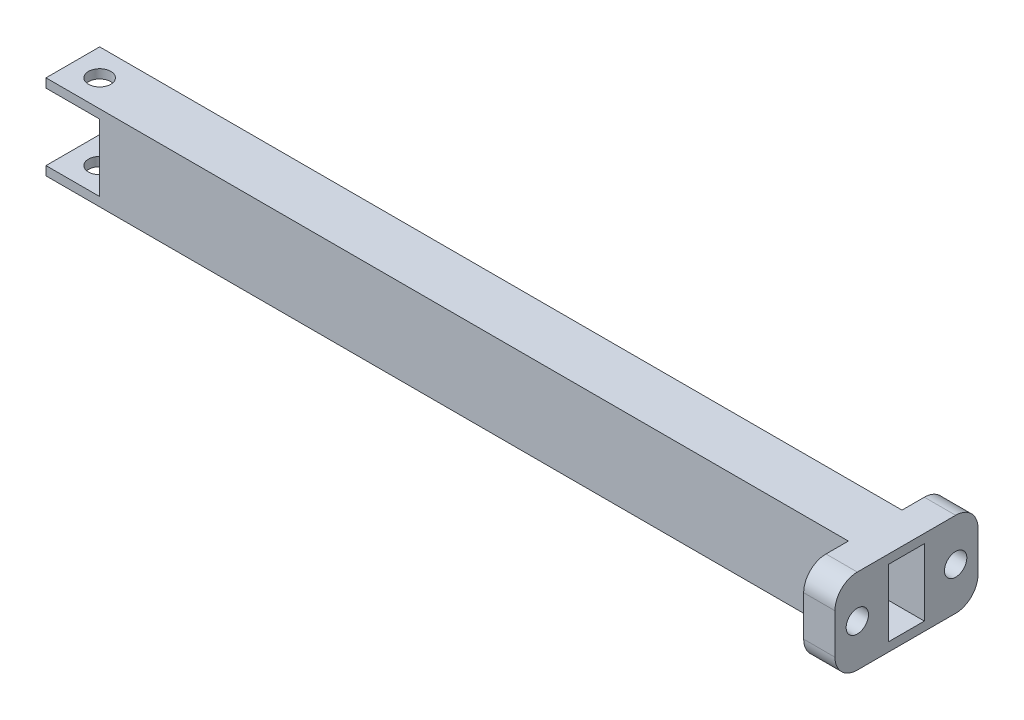
ISO-10303-21;
HEADER;
FILE_DESCRIPTION(('STEP AP214'),'2;1');
FILE_NAME('part.step','',(''),(''),'','','');
FILE_SCHEMA(('AUTOMOTIVE_DESIGN { 1 0 10303 214 1 1 1 1 }'));
ENDSEC;
DATA;
#1=APPLICATION_CONTEXT('core data for automotive mechanical design processes');
#2=APPLICATION_PROTOCOL_DEFINITION('international standard','automotive_design',2000,#1);
#3=PRODUCT_CONTEXT('',#1,'mechanical');
#4=PRODUCT('Part','Part','',(#3));
#5=PRODUCT_RELATED_PRODUCT_CATEGORY('part','',(#4));
#6=PRODUCT_DEFINITION_FORMATION('','',#4);
#7=PRODUCT_DEFINITION_CONTEXT('part definition',#1,'design');
#8=PRODUCT_DEFINITION('design','',#6,#7);
#9=PRODUCT_DEFINITION_SHAPE('','',#8);
#10=(LENGTH_UNIT() NAMED_UNIT(*) SI_UNIT(.MILLI.,.METRE.));
#11=(NAMED_UNIT(*) PLANE_ANGLE_UNIT() SI_UNIT($,.RADIAN.));
#12=(NAMED_UNIT(*) SI_UNIT($,.STERADIAN.) SOLID_ANGLE_UNIT());
#13=UNCERTAINTY_MEASURE_WITH_UNIT(LENGTH_MEASURE(1.E-05),#10,'distance_accuracy_value','');
#14=(GEOMETRIC_REPRESENTATION_CONTEXT(3) GLOBAL_UNCERTAINTY_ASSIGNED_CONTEXT((#13)) GLOBAL_UNIT_ASSIGNED_CONTEXT((#10,
#11,#12)) REPRESENTATION_CONTEXT('',''));
#15=CARTESIAN_POINT('',(0.,0.,0.));
#16=DIRECTION('',(0.,0.,1.));
#17=DIRECTION('',(1.,0.,0.));
#18=AXIS2_PLACEMENT_3D('',#15,#16,#17);
#19=CARTESIAN_POINT('',(186.5,-9.5,6.));
#20=DIRECTION('',(0.,0.,-1.));
#21=DIRECTION('',(-1.,0.,0.));
#22=AXIS2_PLACEMENT_3D('',#19,#20,#21);
#23=PLANE('',#22);
#24=DIRECTION('',(0.,-1.,0.));
#25=VECTOR('',#24,1.);
#26=CARTESIAN_POINT('',(-7.,-9.5,6.));
#27=LINE('',#26,#25);
#28=CARTESIAN_POINT('',(-7.00000000000001,9.5,6.));
#29=VERTEX_POINT('',#28);
#30=CARTESIAN_POINT('',(-7.,-9.5,6.));
#31=VERTEX_POINT('',#30);
#32=EDGE_CURVE('E218',#29,#31,#27,.T.);
#33=ORIENTED_EDGE('',*,*,#32,.F.);
#34=DIRECTION('',(-1.,0.,0.));
#35=VECTOR('',#34,1.);
#36=CARTESIAN_POINT('',(186.5,9.5,6.));
#37=LINE('',#36,#35);
#38=CARTESIAN_POINT('',(-186.5,9.5,6.));
#39=VERTEX_POINT('',#38);
#40=EDGE_CURVE('E202',#29,#39,#37,.T.);
#41=ORIENTED_EDGE('',*,*,#40,.T.);
#42=DIRECTION('',(0.,-1.,0.));
#43=VECTOR('',#42,1.);
#44=CARTESIAN_POINT('',(-186.5,-9.5,6.));
#45=LINE('',#44,#43);
#46=CARTESIAN_POINT('',(-186.5,7.5,6.));
#47=VERTEX_POINT('',#46);
#48=EDGE_CURVE('E351',#39,#47,#45,.T.);
#49=ORIENTED_EDGE('',*,*,#48,.T.);
#50=DIRECTION('',(-1.,0.,0.));
#51=VECTOR('',#50,1.);
#52=CARTESIAN_POINT('',(-186.5,7.5,6.));
#53=LINE('',#52,#51);
#54=CARTESIAN_POINT('',(-174.5,7.5,6.));
#55=VERTEX_POINT('',#54);
#56=EDGE_CURVE('E307',#55,#47,#53,.T.);
#57=ORIENTED_EDGE('',*,*,#56,.F.);
#58=DIRECTION('',(0.,1.,0.));
#59=VECTOR('',#58,1.);
#60=CARTESIAN_POINT('',(-174.5,7.5,6.));
#61=LINE('',#60,#59);
#62=CARTESIAN_POINT('',(-174.5,-7.5,6.));
#63=VERTEX_POINT('',#62);
#64=EDGE_CURVE('E315',#63,#55,#61,.T.);
#65=ORIENTED_EDGE('',*,*,#64,.F.);
#66=DIRECTION('',(1.,0.,0.));
#67=VECTOR('',#66,1.);
#68=CARTESIAN_POINT('',(-186.5,-7.5,6.));
#69=LINE('',#68,#67);
#70=CARTESIAN_POINT('',(-186.5,-7.5,6.));
#71=VERTEX_POINT('',#70);
#72=EDGE_CURVE('E302',#71,#63,#69,.T.);
#73=ORIENTED_EDGE('',*,*,#72,.F.);
#74=CARTESIAN_POINT('',(-186.5,-9.5,6.));
#75=VERTEX_POINT('',#74);
#76=EDGE_CURVE('E350',#71,#75,#45,.T.);
#77=ORIENTED_EDGE('',*,*,#76,.T.);
#78=DIRECTION('',(-1.,0.,0.));
#79=VECTOR('',#78,1.);
#80=CARTESIAN_POINT('',(186.5,-9.5,6.));
#81=LINE('',#80,#79);
#82=EDGE_CURVE('E206',#31,#75,#81,.T.);
#83=ORIENTED_EDGE('',*,*,#82,.F.);
#84=EDGE_LOOP('',(#33,#41,#49,#57,#65,#73,#77,#83));
#85=FACE_BOUND('',#84,.T.);
#86=ADVANCED_FACE('F37',(#85),#23,.F.);
#87=CARTESIAN_POINT('',(-186.5,0.,0.));
#88=DIRECTION('',(-1.,0.,0.));
#89=DIRECTION('',(0.,0.,1.));
#90=AXIS2_PLACEMENT_3D('',#87,#88,#89);
#91=PLANE('',#90);
#92=DIRECTION('',(0.,0.,1.));
#93=VECTOR('',#92,1.);
#94=CARTESIAN_POINT('',(-186.5,7.5,4.));
#95=LINE('',#94,#93);
#96=CARTESIAN_POINT('',(-186.5,7.5,-6.));
#97=VERTEX_POINT('',#96);
#98=EDGE_CURVE('E333',#97,#47,#95,.T.);
#99=ORIENTED_EDGE('',*,*,#98,.T.);
#100=ORIENTED_EDGE('',*,*,#48,.F.);
#101=DIRECTION('',(0.,0.,1.));
#102=VECTOR('',#101,1.);
#103=CARTESIAN_POINT('',(-186.5,9.5,6.));
#104=LINE('',#103,#102);
#105=CARTESIAN_POINT('',(-186.5,9.5,-6.));
#106=VERTEX_POINT('',#105);
#107=EDGE_CURVE('E348',#106,#39,#104,.T.);
#108=ORIENTED_EDGE('',*,*,#107,.F.);
#109=DIRECTION('',(0.,1.,0.));
#110=VECTOR('',#109,1.);
#111=CARTESIAN_POINT('',(-186.5,-9.5,-6.));
#112=LINE('',#111,#110);
#113=EDGE_CURVE('E199',#97,#106,#112,.T.);
#114=ORIENTED_EDGE('',*,*,#113,.F.);
#115=EDGE_LOOP('',(#99,#100,#108,#114));
#116=FACE_BOUND('',#115,.T.);
#117=ADVANCED_FACE('F385',(#116),#91,.T.);
#118=DIRECTION('',(0.,0.,-1.));
#119=VECTOR('',#118,1.);
#120=CARTESIAN_POINT('',(-186.5,-7.5,4.));
#121=LINE('',#120,#119);
#122=CARTESIAN_POINT('',(-186.5,-7.5,-6.));
#123=VERTEX_POINT('',#122);
#124=EDGE_CURVE('E335',#71,#123,#121,.T.);
#125=ORIENTED_EDGE('',*,*,#124,.T.);
#126=CARTESIAN_POINT('',(-186.5,-9.5,-6.));
#127=VERTEX_POINT('',#126);
#128=EDGE_CURVE('E345',#127,#123,#112,.T.);
#129=ORIENTED_EDGE('',*,*,#128,.F.);
#130=DIRECTION('',(0.,0.,-1.));
#131=VECTOR('',#130,1.);
#132=CARTESIAN_POINT('',(-186.5,-9.5,6.));
#133=LINE('',#132,#131);
#134=EDGE_CURVE('E354',#75,#127,#133,.T.);
#135=ORIENTED_EDGE('',*,*,#134,.F.);
#136=ORIENTED_EDGE('',*,*,#76,.F.);
#137=EDGE_LOOP('',(#125,#129,#135,#136));
#138=FACE_BOUND('',#137,.T.);
#139=ADVANCED_FACE('F367',(#138),#91,.T.);
#140=CARTESIAN_POINT('',(186.5,-9.5,-6.));
#141=DIRECTION('',(0.,0.,1.));
#142=DIRECTION('',(1.,0.,0.));
#143=AXIS2_PLACEMENT_3D('',#140,#141,#142);
#144=PLANE('',#143);
#145=DIRECTION('',(-1.,0.,0.));
#146=VECTOR('',#145,1.);
#147=CARTESIAN_POINT('',(186.5,9.5,-6.));
#148=LINE('',#147,#146);
#149=CARTESIAN_POINT('',(-7.,9.5,-6.));
#150=VERTEX_POINT('',#149);
#151=EDGE_CURVE('E181',#150,#106,#148,.T.);
#152=ORIENTED_EDGE('',*,*,#151,.F.);
#153=DIRECTION('',(0.,-1.,0.));
#154=VECTOR('',#153,1.);
#155=CARTESIAN_POINT('',(-7.,-9.5,-6.));
#156=LINE('',#155,#154);
#157=CARTESIAN_POINT('',(-7.00000000000001,-9.5,-6.));
#158=VERTEX_POINT('',#157);
#159=EDGE_CURVE('E188',#150,#158,#156,.T.);
#160=ORIENTED_EDGE('',*,*,#159,.T.);
#161=DIRECTION('',(-1.,0.,0.));
#162=VECTOR('',#161,1.);
#163=CARTESIAN_POINT('',(186.5,-9.5,-6.));
#164=LINE('',#163,#162);
#165=EDGE_CURVE('E259',#158,#127,#164,.T.);
#166=ORIENTED_EDGE('',*,*,#165,.T.);
#167=ORIENTED_EDGE('',*,*,#128,.T.);
#168=DIRECTION('',(1.,0.,0.));
#169=VECTOR('',#168,1.);
#170=CARTESIAN_POINT('',(-186.5,-7.5,-6.));
#171=LINE('',#170,#169);
#172=CARTESIAN_POINT('',(-174.5,-7.5,-6.));
#173=VERTEX_POINT('',#172);
#174=EDGE_CURVE('E303',#123,#173,#171,.T.);
#175=ORIENTED_EDGE('',*,*,#174,.T.);
#176=DIRECTION('',(0.,1.,0.));
#177=VECTOR('',#176,1.);
#178=CARTESIAN_POINT('',(-174.5,7.5,-6.));
#179=LINE('',#178,#177);
#180=CARTESIAN_POINT('',(-174.5,7.5,-6.));
#181=VERTEX_POINT('',#180);
#182=EDGE_CURVE('E306',#173,#181,#179,.T.);
#183=ORIENTED_EDGE('',*,*,#182,.T.);
#184=DIRECTION('',(-1.,0.,0.));
#185=VECTOR('',#184,1.);
#186=CARTESIAN_POINT('',(-186.5,7.5,-6.));
#187=LINE('',#186,#185);
#188=EDGE_CURVE('E310',#181,#97,#187,.T.);
#189=ORIENTED_EDGE('',*,*,#188,.T.);
#190=ORIENTED_EDGE('',*,*,#113,.T.);
#191=EDGE_LOOP('',(#152,#160,#166,#167,#175,#183,#189,#190));
#192=FACE_BOUND('',#191,.T.);
#193=ADVANCED_FACE('F196',(#192),#144,.F.);
#194=CARTESIAN_POINT('',(186.5,9.5,6.));
#195=DIRECTION('',(0.,-1.,0.));
#196=DIRECTION('',(0.,0.,-1.));
#197=AXIS2_PLACEMENT_3D('',#194,#195,#196);
#198=PLANE('',#197);
#199=CARTESIAN_POINT('',(-180.5,9.5,0.));
#200=DIRECTION('',(0.,1.,0.));
#201=DIRECTION('',(0.,0.,1.));
#202=AXIS2_PLACEMENT_3D('',#199,#200,#201);
#203=CIRCLE('',#202,2.5);
#204=CARTESIAN_POINT('',(-180.5,9.5,2.5));
#205=VERTEX_POINT('',#204);
#206=EDGE_CURVE('E295',#205,#205,#203,.T.);
#207=ORIENTED_EDGE('',*,*,#206,.F.);
#208=EDGE_LOOP('',(#207));
#209=FACE_BOUND('',#208,.T.);
#210=DIRECTION('',(0.,0.,1.));
#211=VECTOR('',#210,1.);
#212=CARTESIAN_POINT('',(0.,9.5,-6.));
#213=LINE('',#212,#211);
#214=CARTESIAN_POINT('',(0.,9.5,-11.));
#215=VERTEX_POINT('',#214);
#216=CARTESIAN_POINT('',(0.,9.5,11.));
#217=VERTEX_POINT('',#216);
#218=EDGE_CURVE('E286',#215,#217,#213,.T.);
#219=ORIENTED_EDGE('',*,*,#218,.F.);
#220=DIRECTION('',(-1.,0.,0.));
#221=VECTOR('',#220,1.);
#222=CARTESIAN_POINT('',(-7.00000000000001,9.5,-11.));
#223=LINE('',#222,#221);
#224=CARTESIAN_POINT('',(-7.,9.5,-11.));
#225=VERTEX_POINT('',#224);
#226=EDGE_CURVE('E11',#215,#225,#223,.T.);
#227=ORIENTED_EDGE('',*,*,#226,.T.);
#228=DIRECTION('',(0.,0.,1.));
#229=VECTOR('',#228,1.);
#230=CARTESIAN_POINT('',(-7.,9.5,-16.));
#231=LINE('',#230,#229);
#232=EDGE_CURVE('E175',#225,#150,#231,.T.);
#233=ORIENTED_EDGE('',*,*,#232,.T.);
#234=ORIENTED_EDGE('',*,*,#151,.T.);
#235=ORIENTED_EDGE('',*,*,#107,.T.);
#236=ORIENTED_EDGE('',*,*,#40,.F.);
#237=DIRECTION('',(0.,0.,-1.));
#238=VECTOR('',#237,1.);
#239=CARTESIAN_POINT('',(-7.,9.5,16.));
#240=LINE('',#239,#238);
#241=CARTESIAN_POINT('',(-7.,9.5,11.));
#242=VERTEX_POINT('',#241);
#243=EDGE_CURVE('E284',#242,#29,#240,.T.);
#244=ORIENTED_EDGE('',*,*,#243,.F.);
#245=DIRECTION('',(-1.,0.,0.));
#246=VECTOR('',#245,1.);
#247=CARTESIAN_POINT('',(0.,9.5,11.));
#248=LINE('',#247,#246);
#249=EDGE_CURVE('E236',#242,#217,#248,.F.);
#250=ORIENTED_EDGE('',*,*,#249,.T.);
#251=EDGE_LOOP('',(#219,#227,#233,#234,#235,#236,#244,#250));
#252=FACE_BOUND('',#251,.T.);
#253=ADVANCED_FACE('F178',(#209,#252),#198,.F.);
#254=CARTESIAN_POINT('',(186.5,-9.5,6.));
#255=DIRECTION('',(0.,1.,0.));
#256=DIRECTION('',(0.,0.,1.));
#257=AXIS2_PLACEMENT_3D('',#254,#255,#256);
#258=PLANE('',#257);
#259=CARTESIAN_POINT('',(-180.5,-9.5,0.));
#260=DIRECTION('',(0.,1.,0.));
#261=DIRECTION('',(0.,0.,1.));
#262=AXIS2_PLACEMENT_3D('',#259,#260,#261);
#263=CIRCLE('',#262,2.5);
#264=CARTESIAN_POINT('',(-180.5,-9.5,2.5));
#265=VERTEX_POINT('',#264);
#266=EDGE_CURVE('E213',#265,#265,#263,.T.);
#267=ORIENTED_EDGE('',*,*,#266,.T.);
#268=EDGE_LOOP('',(#267));
#269=FACE_BOUND('',#268,.T.);
#270=DIRECTION('',(0.,0.,1.));
#271=VECTOR('',#270,1.);
#272=CARTESIAN_POINT('',(-7.,-9.5,-16.));
#273=LINE('',#272,#271);
#274=CARTESIAN_POINT('',(-7.,-9.5,-11.));
#275=VERTEX_POINT('',#274);
#276=EDGE_CURVE('E184',#275,#158,#273,.T.);
#277=ORIENTED_EDGE('',*,*,#276,.F.);
#278=DIRECTION('',(1.,0.,0.));
#279=VECTOR('',#278,1.);
#280=CARTESIAN_POINT('',(0.,-9.5,-11.));
#281=LINE('',#280,#279);
#282=CARTESIAN_POINT('',(0.,-9.5,-11.));
#283=VERTEX_POINT('',#282);
#284=EDGE_CURVE('E239',#275,#283,#281,.T.);
#285=ORIENTED_EDGE('',*,*,#284,.T.);
#286=DIRECTION('',(0.,0.,1.));
#287=VECTOR('',#286,1.);
#288=CARTESIAN_POINT('',(0.,-9.5,-6.));
#289=LINE('',#288,#287);
#290=CARTESIAN_POINT('',(0.,-9.5,11.));
#291=VERTEX_POINT('',#290);
#292=EDGE_CURVE('E266',#283,#291,#289,.T.);
#293=ORIENTED_EDGE('',*,*,#292,.T.);
#294=DIRECTION('',(1.,0.,0.));
#295=VECTOR('',#294,1.);
#296=CARTESIAN_POINT('',(-7.,-9.5,11.));
#297=LINE('',#296,#295);
#298=CARTESIAN_POINT('',(-7.,-9.5,11.));
#299=VERTEX_POINT('',#298);
#300=EDGE_CURVE('E230',#291,#299,#297,.F.);
#301=ORIENTED_EDGE('',*,*,#300,.T.);
#302=DIRECTION('',(0.,0.,-1.));
#303=VECTOR('',#302,1.);
#304=CARTESIAN_POINT('',(-7.,-9.5,16.));
#305=LINE('',#304,#303);
#306=EDGE_CURVE('E280',#299,#31,#305,.T.);
#307=ORIENTED_EDGE('',*,*,#306,.T.);
#308=ORIENTED_EDGE('',*,*,#82,.T.);
#309=ORIENTED_EDGE('',*,*,#134,.T.);
#310=ORIENTED_EDGE('',*,*,#165,.F.);
#311=EDGE_LOOP('',(#277,#285,#293,#301,#307,#308,#309,#310));
#312=FACE_BOUND('',#311,.T.);
#313=ADVANCED_FACE('F256',(#269,#312),#258,.F.);
#314=CARTESIAN_POINT('',(186.5,-7.5,-4.));
#315=DIRECTION('',(0.,0.,1.));
#316=DIRECTION('',(1.,0.,0.));
#317=AXIS2_PLACEMENT_3D('',#314,#315,#316);
#318=PLANE('',#317);
#319=DIRECTION('',(0.,-1.,0.));
#320=VECTOR('',#319,1.);
#321=CARTESIAN_POINT('',(0.,-7.5,-4.));
#322=LINE('',#321,#320);
#323=CARTESIAN_POINT('',(0.,7.5,-4.));
#324=VERTEX_POINT('',#323);
#325=CARTESIAN_POINT('',(0.,-7.5,-4.));
#326=VERTEX_POINT('',#325);
#327=EDGE_CURVE('E293',#324,#326,#322,.T.);
#328=ORIENTED_EDGE('',*,*,#327,.F.);
#329=DIRECTION('',(-1.,0.,0.));
#330=VECTOR('',#329,1.);
#331=CARTESIAN_POINT('',(186.5,7.5,-4.));
#332=LINE('',#331,#330);
#333=CARTESIAN_POINT('',(-174.5,7.5,-4.));
#334=VERTEX_POINT('',#333);
#335=EDGE_CURVE('E343',#324,#334,#332,.T.);
#336=ORIENTED_EDGE('',*,*,#335,.T.);
#337=DIRECTION('',(0.,1.,0.));
#338=VECTOR('',#337,1.);
#339=CARTESIAN_POINT('',(-174.5,-7.5,-4.));
#340=LINE('',#339,#338);
#341=CARTESIAN_POINT('',(-174.5,-7.5,-4.));
#342=VERTEX_POINT('',#341);
#343=EDGE_CURVE('E330',#342,#334,#340,.T.);
#344=ORIENTED_EDGE('',*,*,#343,.F.);
#345=DIRECTION('',(-1.,0.,0.));
#346=VECTOR('',#345,1.);
#347=CARTESIAN_POINT('',(186.5,-7.5,-4.));
#348=LINE('',#347,#346);
#349=EDGE_CURVE('E337',#326,#342,#348,.T.);
#350=ORIENTED_EDGE('',*,*,#349,.F.);
#351=EDGE_LOOP('',(#328,#336,#344,#350));
#352=FACE_BOUND('',#351,.T.);
#353=ADVANCED_FACE('F468',(#352),#318,.T.);
#354=CARTESIAN_POINT('',(186.5,7.5,4.));
#355=DIRECTION('',(0.,-1.,0.));
#356=DIRECTION('',(0.,0.,-1.));
#357=AXIS2_PLACEMENT_3D('',#354,#355,#356);
#358=PLANE('',#357);
#359=DIRECTION('',(0.,0.,-1.));
#360=VECTOR('',#359,1.);
#361=CARTESIAN_POINT('',(0.,7.5,4.));
#362=LINE('',#361,#360);
#363=CARTESIAN_POINT('',(0.,7.5,4.));
#364=VERTEX_POINT('',#363);
#365=EDGE_CURVE('E291',#364,#324,#362,.T.);
#366=ORIENTED_EDGE('',*,*,#365,.F.);
#367=DIRECTION('',(-1.,0.,0.));
#368=VECTOR('',#367,1.);
#369=CARTESIAN_POINT('',(186.5,7.5,4.));
#370=LINE('',#369,#368);
#371=CARTESIAN_POINT('',(-174.5,7.5,4.));
#372=VERTEX_POINT('',#371);
#373=EDGE_CURVE('E341',#364,#372,#370,.T.);
#374=ORIENTED_EDGE('',*,*,#373,.T.);
#375=DIRECTION('',(0.,0.,1.));
#376=VECTOR('',#375,1.);
#377=CARTESIAN_POINT('',(-174.5,7.5,-6.));
#378=LINE('',#377,#376);
#379=EDGE_CURVE('E324',#372,#55,#378,.T.);
#380=ORIENTED_EDGE('',*,*,#379,.T.);
#381=ORIENTED_EDGE('',*,*,#56,.T.);
#382=ORIENTED_EDGE('',*,*,#98,.F.);
#383=ORIENTED_EDGE('',*,*,#188,.F.);
#384=EDGE_CURVE('E320',#181,#334,#378,.T.);
#385=ORIENTED_EDGE('',*,*,#384,.T.);
#386=ORIENTED_EDGE('',*,*,#335,.F.);
#387=EDGE_LOOP('',(#366,#374,#380,#381,#382,#383,#385,#386));
#388=FACE_BOUND('',#387,.T.);
#389=CARTESIAN_POINT('',(-180.5,7.5,0.));
#390=DIRECTION('',(0.,-1.,0.));
#391=DIRECTION('',(0.,0.,-1.));
#392=AXIS2_PLACEMENT_3D('',#389,#390,#391);
#393=CIRCLE('',#392,2.5);
#394=CARTESIAN_POINT('',(-180.5,7.5,-2.5));
#395=VERTEX_POINT('',#394);
#396=EDGE_CURVE('E212',#395,#395,#393,.T.);
#397=ORIENTED_EDGE('',*,*,#396,.F.);
#398=EDGE_LOOP('',(#397));
#399=FACE_BOUND('',#398,.T.);
#400=ADVANCED_FACE('F382',(#388,#399),#358,.T.);
#401=CARTESIAN_POINT('',(186.5,-7.5,4.));
#402=DIRECTION('',(0.,0.,-1.));
#403=DIRECTION('',(-1.,0.,0.));
#404=AXIS2_PLACEMENT_3D('',#401,#402,#403);
#405=PLANE('',#404);
#406=DIRECTION('',(0.,1.,0.));
#407=VECTOR('',#406,1.);
#408=CARTESIAN_POINT('',(0.,-7.5,4.));
#409=LINE('',#408,#407);
#410=CARTESIAN_POINT('',(0.,-7.5,4.));
#411=VERTEX_POINT('',#410);
#412=EDGE_CURVE('E288',#411,#364,#409,.T.);
#413=ORIENTED_EDGE('',*,*,#412,.F.);
#414=DIRECTION('',(-1.,0.,0.));
#415=VECTOR('',#414,1.);
#416=CARTESIAN_POINT('',(186.5,-7.5,4.));
#417=LINE('',#416,#415);
#418=CARTESIAN_POINT('',(-174.5,-7.5,4.));
#419=VERTEX_POINT('',#418);
#420=EDGE_CURVE('E339',#411,#419,#417,.T.);
#421=ORIENTED_EDGE('',*,*,#420,.T.);
#422=DIRECTION('',(0.,-1.,0.));
#423=VECTOR('',#422,1.);
#424=CARTESIAN_POINT('',(-174.5,-7.5,4.));
#425=LINE('',#424,#423);
#426=EDGE_CURVE('E323',#372,#419,#425,.T.);
#427=ORIENTED_EDGE('',*,*,#426,.F.);
#428=ORIENTED_EDGE('',*,*,#373,.F.);
#429=EDGE_LOOP('',(#413,#421,#427,#428));
#430=FACE_BOUND('',#429,.T.);
#431=ADVANCED_FACE('F462',(#430),#405,.T.);
#432=CARTESIAN_POINT('',(186.5,-7.5,4.));
#433=DIRECTION('',(0.,1.,0.));
#434=DIRECTION('',(0.,0.,1.));
#435=AXIS2_PLACEMENT_3D('',#432,#433,#434);
#436=PLANE('',#435);
#437=DIRECTION('',(0.,0.,1.));
#438=VECTOR('',#437,1.);
#439=CARTESIAN_POINT('',(0.,-7.5,4.));
#440=LINE('',#439,#438);
#441=EDGE_CURVE('E201',#326,#411,#440,.T.);
#442=ORIENTED_EDGE('',*,*,#441,.F.);
#443=ORIENTED_EDGE('',*,*,#349,.T.);
#444=DIRECTION('',(0.,0.,1.));
#445=VECTOR('',#444,1.);
#446=CARTESIAN_POINT('',(-174.5,-7.5,-6.));
#447=LINE('',#446,#445);
#448=EDGE_CURVE('E325',#173,#342,#447,.T.);
#449=ORIENTED_EDGE('',*,*,#448,.F.);
#450=ORIENTED_EDGE('',*,*,#174,.F.);
#451=ORIENTED_EDGE('',*,*,#124,.F.);
#452=ORIENTED_EDGE('',*,*,#72,.T.);
#453=EDGE_CURVE('E312',#419,#63,#447,.T.);
#454=ORIENTED_EDGE('',*,*,#453,.F.);
#455=ORIENTED_EDGE('',*,*,#420,.F.);
#456=EDGE_LOOP('',(#442,#443,#449,#450,#451,#452,#454,#455));
#457=FACE_BOUND('',#456,.T.);
#458=CARTESIAN_POINT('',(-180.5,-7.5,0.));
#459=DIRECTION('',(0.,1.,0.));
#460=DIRECTION('',(0.,0.,1.));
#461=AXIS2_PLACEMENT_3D('',#458,#459,#460);
#462=CIRCLE('',#461,2.5);
#463=CARTESIAN_POINT('',(-180.5,-7.5,2.5));
#464=VERTEX_POINT('',#463);
#465=EDGE_CURVE('E210',#464,#464,#462,.T.);
#466=ORIENTED_EDGE('',*,*,#465,.F.);
#467=EDGE_LOOP('',(#466));
#468=FACE_BOUND('',#467,.T.);
#469=ADVANCED_FACE('F372',(#457,#468),#436,.T.);
#470=CARTESIAN_POINT('',(-174.5,7.5,-6.));
#471=DIRECTION('',(1.,0.,0.));
#472=DIRECTION('',(0.,0.,-1.));
#473=AXIS2_PLACEMENT_3D('',#470,#471,#472);
#474=PLANE('',#473);
#475=ORIENTED_EDGE('',*,*,#426,.T.);
#476=ORIENTED_EDGE('',*,*,#453,.T.);
#477=ORIENTED_EDGE('',*,*,#64,.T.);
#478=ORIENTED_EDGE('',*,*,#379,.F.);
#479=EDGE_LOOP('',(#475,#476,#477,#478));
#480=FACE_BOUND('',#479,.T.);
#481=ADVANCED_FACE('F457',(#480),#474,.F.);
#482=ORIENTED_EDGE('',*,*,#343,.T.);
#483=ORIENTED_EDGE('',*,*,#384,.F.);
#484=ORIENTED_EDGE('',*,*,#182,.F.);
#485=ORIENTED_EDGE('',*,*,#448,.T.);
#486=EDGE_LOOP('',(#482,#483,#484,#485));
#487=FACE_BOUND('',#486,.T.);
#488=ADVANCED_FACE('F377',(#487),#474,.F.);
#489=CARTESIAN_POINT('',(-180.5,-9.5,0.));
#490=DIRECTION('',(0.,1.,0.));
#491=DIRECTION('',(0.,0.,1.));
#492=AXIS2_PLACEMENT_3D('',#489,#490,#491);
#493=CYLINDRICAL_SURFACE('',#492,2.5);
#494=ORIENTED_EDGE('',*,*,#465,.T.);
#495=EDGE_LOOP('',(#494));
#496=FACE_BOUND('',#495,.T.);
#497=ORIENTED_EDGE('',*,*,#266,.F.);
#498=EDGE_LOOP('',(#497));
#499=FACE_BOUND('',#498,.T.);
#500=ADVANCED_FACE('F453',(#496,#499),#493,.F.);
#501=ORIENTED_EDGE('',*,*,#396,.T.);
#502=EDGE_LOOP('',(#501));
#503=FACE_BOUND('',#502,.T.);
#504=ORIENTED_EDGE('',*,*,#206,.T.);
#505=EDGE_LOOP('',(#504));
#506=FACE_BOUND('',#505,.T.);
#507=ADVANCED_FACE('F451',(#503,#506),#493,.F.);
#508=CARTESIAN_POINT('',(0.,-9.5,-6.));
#509=DIRECTION('',(-1.,0.,0.));
#510=DIRECTION('',(0.,0.,1.));
#511=AXIS2_PLACEMENT_3D('',#508,#509,#510);
#512=PLANE('',#511);
#513=CARTESIAN_POINT('',(0.,0.,-11.));
#514=DIRECTION('',(-1.,0.,0.));
#515=DIRECTION('',(0.,0.,1.));
#516=AXIS2_PLACEMENT_3D('',#513,#514,#515);
#517=CIRCLE('',#516,2.5);
#518=CARTESIAN_POINT('',(0.,0.,-8.5));
#519=VERTEX_POINT('',#518);
#520=EDGE_CURVE('E242',#519,#519,#517,.T.);
#521=ORIENTED_EDGE('',*,*,#520,.T.);
#522=EDGE_LOOP('',(#521));
#523=FACE_BOUND('',#522,.T.);
#524=CARTESIAN_POINT('',(0.,0.,11.));
#525=DIRECTION('',(1.,0.,0.));
#526=DIRECTION('',(0.,0.,-1.));
#527=AXIS2_PLACEMENT_3D('',#524,#525,#526);
#528=CIRCLE('',#527,2.5);
#529=CARTESIAN_POINT('',(0.,0.,8.5));
#530=VERTEX_POINT('',#529);
#531=EDGE_CURVE('E219',#530,#530,#528,.T.);
#532=ORIENTED_EDGE('',*,*,#531,.F.);
#533=EDGE_LOOP('',(#532));
#534=FACE_BOUND('',#533,.T.);
#535=ORIENTED_EDGE('',*,*,#327,.T.);
#536=ORIENTED_EDGE('',*,*,#441,.T.);
#537=ORIENTED_EDGE('',*,*,#412,.T.);
#538=ORIENTED_EDGE('',*,*,#365,.T.);
#539=EDGE_LOOP('',(#535,#536,#537,#538));
#540=FACE_BOUND('',#539,.T.);
#541=ORIENTED_EDGE('',*,*,#292,.F.);
#542=CARTESIAN_POINT('',(0.,-4.5,-11.));
#543=DIRECTION('',(-1.,0.,0.));
#544=DIRECTION('',(0.,0.,1.));
#545=AXIS2_PLACEMENT_3D('',#542,#543,#544);
#546=CIRCLE('',#545,5.);
#547=CARTESIAN_POINT('',(0.,-4.5,-16.));
#548=VERTEX_POINT('',#547);
#549=EDGE_CURVE('E247',#283,#548,#546,.F.);
#550=ORIENTED_EDGE('',*,*,#549,.T.);
#551=DIRECTION('',(0.,1.,0.));
#552=VECTOR('',#551,1.);
#553=CARTESIAN_POINT('',(0.,-9.5,-16.));
#554=LINE('',#553,#552);
#555=CARTESIAN_POINT('',(0.,4.5,-16.));
#556=VERTEX_POINT('',#555);
#557=EDGE_CURVE('E193',#548,#556,#554,.T.);
#558=ORIENTED_EDGE('',*,*,#557,.T.);
#559=CARTESIAN_POINT('',(0.,4.5,-11.));
#560=DIRECTION('',(-1.,0.,0.));
#561=DIRECTION('',(0.,0.,1.));
#562=AXIS2_PLACEMENT_3D('',#559,#560,#561);
#563=CIRCLE('',#562,5.);
#564=EDGE_CURVE('E245',#556,#215,#563,.F.);
#565=ORIENTED_EDGE('',*,*,#564,.T.);
#566=ORIENTED_EDGE('',*,*,#218,.T.);
#567=CARTESIAN_POINT('',(0.,4.5,11.));
#568=DIRECTION('',(-1.,0.,0.));
#569=DIRECTION('',(0.,0.,1.));
#570=AXIS2_PLACEMENT_3D('',#567,#568,#569);
#571=CIRCLE('',#570,5.);
#572=CARTESIAN_POINT('',(0.,4.5,16.));
#573=VERTEX_POINT('',#572);
#574=EDGE_CURVE('E225',#217,#573,#571,.F.);
#575=ORIENTED_EDGE('',*,*,#574,.T.);
#576=DIRECTION('',(0.,1.,0.));
#577=VECTOR('',#576,1.);
#578=CARTESIAN_POINT('',(0.,-9.5,16.));
#579=LINE('',#578,#577);
#580=CARTESIAN_POINT('',(0.,-4.5,16.));
#581=VERTEX_POINT('',#580);
#582=EDGE_CURVE('E274',#581,#573,#579,.T.);
#583=ORIENTED_EDGE('',*,*,#582,.F.);
#584=CARTESIAN_POINT('',(0.,-4.5,11.));
#585=DIRECTION('',(-1.,0.,0.));
#586=DIRECTION('',(0.,0.,1.));
#587=AXIS2_PLACEMENT_3D('',#584,#585,#586);
#588=CIRCLE('',#587,5.);
#589=EDGE_CURVE('E227',#581,#291,#588,.F.);
#590=ORIENTED_EDGE('',*,*,#589,.T.);
#591=EDGE_LOOP('',(#541,#550,#558,#565,#566,#575,#583,#590));
#592=FACE_BOUND('',#591,.T.);
#593=ADVANCED_FACE('F264',(#523,#534,#540,#592),#512,.F.);
#594=CARTESIAN_POINT('',(-7.,-9.5,16.));
#595=DIRECTION('',(1.,0.,0.));
#596=DIRECTION('',(0.,1.,0.));
#597=AXIS2_PLACEMENT_3D('',#594,#595,#596);
#598=PLANE('',#597);
#599=CARTESIAN_POINT('',(-7.,0.,11.));
#600=DIRECTION('',(1.,0.,0.));
#601=DIRECTION('',(0.,1.,0.));
#602=AXIS2_PLACEMENT_3D('',#599,#600,#601);
#603=CIRCLE('',#602,2.5);
#604=CARTESIAN_POINT('',(-7.,2.5,11.));
#605=VERTEX_POINT('',#604);
#606=EDGE_CURVE('E215',#605,#605,#603,.T.);
#607=ORIENTED_EDGE('',*,*,#606,.T.);
#608=EDGE_LOOP('',(#607));
#609=FACE_BOUND('',#608,.T.);
#610=ORIENTED_EDGE('',*,*,#306,.F.);
#611=CARTESIAN_POINT('',(-7.,-4.5,11.));
#612=DIRECTION('',(1.,0.,0.));
#613=DIRECTION('',(0.,1.,0.));
#614=AXIS2_PLACEMENT_3D('',#611,#612,#613);
#615=CIRCLE('',#614,5.);
#616=CARTESIAN_POINT('',(-7.,-4.5,16.));
#617=VERTEX_POINT('',#616);
#618=EDGE_CURVE('E234',#299,#617,#615,.F.);
#619=ORIENTED_EDGE('',*,*,#618,.T.);
#620=DIRECTION('',(0.,-1.,0.));
#621=VECTOR('',#620,1.);
#622=CARTESIAN_POINT('',(-7.,-9.5,16.));
#623=LINE('',#622,#621);
#624=CARTESIAN_POINT('',(-7.,4.5,16.));
#625=VERTEX_POINT('',#624);
#626=EDGE_CURVE('E277',#625,#617,#623,.T.);
#627=ORIENTED_EDGE('',*,*,#626,.F.);
#628=CARTESIAN_POINT('',(-7.,4.5,11.));
#629=DIRECTION('',(1.,0.,0.));
#630=DIRECTION('',(0.,1.,0.));
#631=AXIS2_PLACEMENT_3D('',#628,#629,#630);
#632=CIRCLE('',#631,5.);
#633=EDGE_CURVE('E232',#625,#242,#632,.F.);
#634=ORIENTED_EDGE('',*,*,#633,.T.);
#635=ORIENTED_EDGE('',*,*,#243,.T.);
#636=ORIENTED_EDGE('',*,*,#32,.T.);
#637=EDGE_LOOP('',(#610,#619,#627,#634,#635,#636));
#638=FACE_BOUND('',#637,.T.);
#639=ADVANCED_FACE('F392',(#609,#638),#598,.F.);
#640=CARTESIAN_POINT('',(0.,0.,16.));
#641=DIRECTION('',(0.,0.,1.));
#642=DIRECTION('',(1.,0.,0.));
#643=AXIS2_PLACEMENT_3D('',#640,#641,#642);
#644=PLANE('',#643);
#645=ORIENTED_EDGE('',*,*,#626,.T.);
#646=DIRECTION('',(1.,0.,0.));
#647=VECTOR('',#646,1.);
#648=CARTESIAN_POINT('',(0.,-4.5,16.));
#649=LINE('',#648,#647);
#650=EDGE_CURVE('E222',#617,#581,#649,.T.);
#651=ORIENTED_EDGE('',*,*,#650,.T.);
#652=ORIENTED_EDGE('',*,*,#582,.T.);
#653=DIRECTION('',(-1.,0.,0.));
#654=VECTOR('',#653,1.);
#655=CARTESIAN_POINT('',(-7.,4.5,16.));
#656=LINE('',#655,#654);
#657=EDGE_CURVE('E204',#573,#625,#656,.T.);
#658=ORIENTED_EDGE('',*,*,#657,.T.);
#659=EDGE_LOOP('',(#645,#651,#652,#658));
#660=FACE_BOUND('',#659,.T.);
#661=ADVANCED_FACE('F400',(#660),#644,.T.);
#662=CARTESIAN_POINT('',(-10.,0.,11.));
#663=DIRECTION('',(1.,0.,0.));
#664=DIRECTION('',(0.,0.,-1.));
#665=AXIS2_PLACEMENT_3D('',#662,#663,#664);
#666=CYLINDRICAL_SURFACE('',#665,2.5);
#667=ORIENTED_EDGE('',*,*,#531,.T.);
#668=EDGE_LOOP('',(#667));
#669=FACE_BOUND('',#668,.T.);
#670=ORIENTED_EDGE('',*,*,#606,.F.);
#671=EDGE_LOOP('',(#670));
#672=FACE_BOUND('',#671,.T.);
#673=ADVANCED_FACE('F427',(#669,#672),#666,.F.);
#674=CARTESIAN_POINT('',(0.,-4.5,11.));
#675=DIRECTION('',(-1.,0.,0.));
#676=DIRECTION('',(0.,0.,1.));
#677=AXIS2_PLACEMENT_3D('',#674,#675,#676);
#678=CYLINDRICAL_SURFACE('',#677,5.);
#679=ORIENTED_EDGE('',*,*,#618,.F.);
#680=ORIENTED_EDGE('',*,*,#300,.F.);
#681=ORIENTED_EDGE('',*,*,#589,.F.);
#682=ORIENTED_EDGE('',*,*,#650,.F.);
#683=EDGE_LOOP('',(#679,#680,#681,#682));
#684=FACE_BOUND('',#683,.T.);
#685=ADVANCED_FACE('F424',(#684),#678,.T.);
#686=CARTESIAN_POINT('',(0.,4.5,11.));
#687=DIRECTION('',(1.,0.,0.));
#688=DIRECTION('',(0.,0.,-1.));
#689=AXIS2_PLACEMENT_3D('',#686,#687,#688);
#690=CYLINDRICAL_SURFACE('',#689,5.);
#691=ORIENTED_EDGE('',*,*,#574,.F.);
#692=ORIENTED_EDGE('',*,*,#249,.F.);
#693=ORIENTED_EDGE('',*,*,#633,.F.);
#694=ORIENTED_EDGE('',*,*,#657,.F.);
#695=EDGE_LOOP('',(#691,#692,#693,#694));
#696=FACE_BOUND('',#695,.T.);
#697=ADVANCED_FACE('F398',(#696),#690,.T.);
#698=CARTESIAN_POINT('',(-7.,-9.5,-16.));
#699=DIRECTION('',(-1.,0.,0.));
#700=DIRECTION('',(0.,-1.,0.));
#701=AXIS2_PLACEMENT_3D('',#698,#699,#700);
#702=PLANE('',#701);
#703=CARTESIAN_POINT('',(-7.,0.,-11.));
#704=DIRECTION('',(-1.,0.,0.));
#705=DIRECTION('',(0.,-1.,0.));
#706=AXIS2_PLACEMENT_3D('',#703,#704,#705);
#707=CIRCLE('',#706,2.5);
#708=CARTESIAN_POINT('',(-7.,-2.5,-11.));
#709=VERTEX_POINT('',#708);
#710=EDGE_CURVE('E194',#709,#709,#707,.F.);
#711=ORIENTED_EDGE('',*,*,#710,.T.);
#712=EDGE_LOOP('',(#711));
#713=FACE_BOUND('',#712,.T.);
#714=DIRECTION('',(0.,-1.,0.));
#715=VECTOR('',#714,1.);
#716=CARTESIAN_POINT('',(-7.,-9.5,-16.));
#717=LINE('',#716,#715);
#718=CARTESIAN_POINT('',(-7.,4.5,-16.));
#719=VERTEX_POINT('',#718);
#720=CARTESIAN_POINT('',(-7.,-4.5,-16.));
#721=VERTEX_POINT('',#720);
#722=EDGE_CURVE('E185',#719,#721,#717,.T.);
#723=ORIENTED_EDGE('',*,*,#722,.T.);
#724=CARTESIAN_POINT('',(-7.00000000000001,-4.5,-11.));
#725=DIRECTION('',(-1.,0.,0.));
#726=DIRECTION('',(0.,-1.,0.));
#727=AXIS2_PLACEMENT_3D('',#724,#725,#726);
#728=CIRCLE('',#727,5.);
#729=EDGE_CURVE('E45',#721,#275,#728,.T.);
#730=ORIENTED_EDGE('',*,*,#729,.T.);
#731=ORIENTED_EDGE('',*,*,#276,.T.);
#732=ORIENTED_EDGE('',*,*,#159,.F.);
#733=ORIENTED_EDGE('',*,*,#232,.F.);
#734=CARTESIAN_POINT('',(-7.00000000000001,4.5,-11.));
#735=DIRECTION('',(-1.,0.,0.));
#736=DIRECTION('',(0.,-1.,0.));
#737=AXIS2_PLACEMENT_3D('',#734,#735,#736);
#738=CIRCLE('',#737,5.);
#739=EDGE_CURVE('E52',#225,#719,#738,.T.);
#740=ORIENTED_EDGE('',*,*,#739,.T.);
#741=EDGE_LOOP('',(#723,#730,#731,#732,#733,#740));
#742=FACE_BOUND('',#741,.T.);
#743=ADVANCED_FACE('F189',(#713,#742),#702,.T.);
#744=CARTESIAN_POINT('',(0.,0.,-16.));
#745=DIRECTION('',(0.,0.,-1.));
#746=DIRECTION('',(1.,0.,0.));
#747=AXIS2_PLACEMENT_3D('',#744,#745,#746);
#748=PLANE('',#747);
#749=ORIENTED_EDGE('',*,*,#557,.F.);
#750=DIRECTION('',(1.,0.,0.));
#751=VECTOR('',#750,1.);
#752=CARTESIAN_POINT('',(-7.00000000000001,-4.5,-16.));
#753=LINE('',#752,#751);
#754=EDGE_CURVE('E59',#548,#721,#753,.F.);
#755=ORIENTED_EDGE('',*,*,#754,.T.);
#756=ORIENTED_EDGE('',*,*,#722,.F.);
#757=DIRECTION('',(-1.,0.,0.));
#758=VECTOR('',#757,1.);
#759=CARTESIAN_POINT('',(0.,4.5,-16.));
#760=LINE('',#759,#758);
#761=EDGE_CURVE('E249',#719,#556,#760,.F.);
#762=ORIENTED_EDGE('',*,*,#761,.T.);
#763=EDGE_LOOP('',(#749,#755,#756,#762));
#764=FACE_BOUND('',#763,.T.);
#765=ADVANCED_FACE('F267',(#764),#748,.T.);
#766=CARTESIAN_POINT('',(-10.,0.,-11.));
#767=DIRECTION('',(1.,0.,0.));
#768=DIRECTION('',(0.,0.,-1.));
#769=AXIS2_PLACEMENT_3D('',#766,#767,#768);
#770=CYLINDRICAL_SURFACE('',#769,2.5);
#771=ORIENTED_EDGE('',*,*,#710,.F.);
#772=EDGE_LOOP('',(#771));
#773=FACE_BOUND('',#772,.T.);
#774=ORIENTED_EDGE('',*,*,#520,.F.);
#775=EDGE_LOOP('',(#774));
#776=FACE_BOUND('',#775,.T.);
#777=ADVANCED_FACE('F408',(#773,#776),#770,.F.);
#778=CARTESIAN_POINT('',(186.5,-4.5,-11.));
#779=DIRECTION('',(-1.,0.,0.));
#780=DIRECTION('',(0.,0.,1.));
#781=AXIS2_PLACEMENT_3D('',#778,#779,#780);
#782=CYLINDRICAL_SURFACE('',#781,5.);
#783=ORIENTED_EDGE('',*,*,#729,.F.);
#784=ORIENTED_EDGE('',*,*,#754,.F.);
#785=ORIENTED_EDGE('',*,*,#549,.F.);
#786=ORIENTED_EDGE('',*,*,#284,.F.);
#787=EDGE_LOOP('',(#783,#784,#785,#786));
#788=FACE_BOUND('',#787,.T.);
#789=ADVANCED_FACE('F261',(#788),#782,.T.);
#790=CARTESIAN_POINT('',(186.5,4.5,-11.));
#791=DIRECTION('',(1.,0.,0.));
#792=DIRECTION('',(0.,0.,-1.));
#793=AXIS2_PLACEMENT_3D('',#790,#791,#792);
#794=CYLINDRICAL_SURFACE('',#793,5.);
#795=ORIENTED_EDGE('',*,*,#564,.F.);
#796=ORIENTED_EDGE('',*,*,#761,.F.);
#797=ORIENTED_EDGE('',*,*,#739,.F.);
#798=ORIENTED_EDGE('',*,*,#226,.F.);
#799=EDGE_LOOP('',(#795,#796,#797,#798));
#800=FACE_BOUND('',#799,.T.);
#801=ADVANCED_FACE('F39',(#800),#794,.T.);
#802=CLOSED_SHELL('',(#86,#117,#139,#193,#253,#313,#353,#400,#431,#469,#481,#488,#500,#507,#593,
#639,#661,#673,#685,#697,#743,#765,#777,#789,#801));
#803=MANIFOLD_SOLID_BREP('B2',#802);
#804=ADVANCED_BREP_SHAPE_REPRESENTATION('',(#18,#803),#14);
#805=SHAPE_DEFINITION_REPRESENTATION(#9,#804);
ENDSEC;
END-ISO-10303-21;
